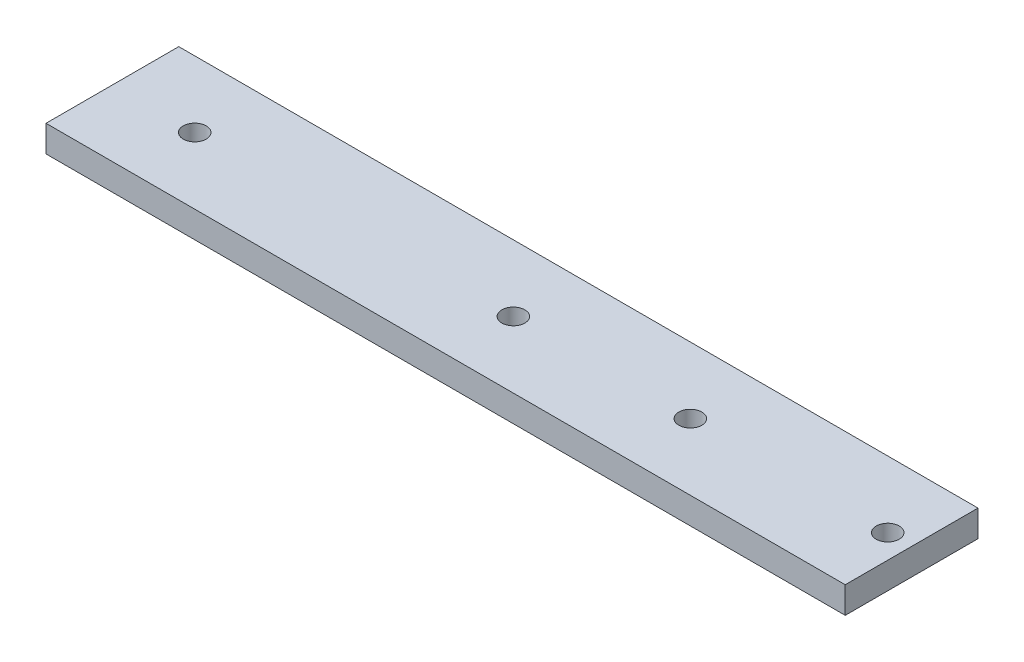
ISO-10303-21;
HEADER;
FILE_DESCRIPTION(('STEP AP214'),'2;1');
FILE_NAME('part.step','',(''),(''),'','','');
FILE_SCHEMA(('AUTOMOTIVE_DESIGN { 1 0 10303 214 1 1 1 1 }'));
ENDSEC;
DATA;
#1=APPLICATION_CONTEXT('core data for automotive mechanical design processes');
#2=APPLICATION_PROTOCOL_DEFINITION('international standard','automotive_design',2000,#1);
#3=PRODUCT_CONTEXT('',#1,'mechanical');
#4=PRODUCT('Part','Part','',(#3));
#5=PRODUCT_RELATED_PRODUCT_CATEGORY('part','',(#4));
#6=PRODUCT_DEFINITION_FORMATION('','',#4);
#7=PRODUCT_DEFINITION_CONTEXT('part definition',#1,'design');
#8=PRODUCT_DEFINITION('design','',#6,#7);
#9=PRODUCT_DEFINITION_SHAPE('','',#8);
#10=(LENGTH_UNIT() NAMED_UNIT(*) SI_UNIT(.MILLI.,.METRE.));
#11=(NAMED_UNIT(*) PLANE_ANGLE_UNIT() SI_UNIT($,.RADIAN.));
#12=(NAMED_UNIT(*) SI_UNIT($,.STERADIAN.) SOLID_ANGLE_UNIT());
#13=UNCERTAINTY_MEASURE_WITH_UNIT(LENGTH_MEASURE(1.E-05),#10,'distance_accuracy_value','');
#14=(GEOMETRIC_REPRESENTATION_CONTEXT(3) GLOBAL_UNCERTAINTY_ASSIGNED_CONTEXT((#13)) GLOBAL_UNIT_ASSIGNED_CONTEXT((#10,
#11,#12)) REPRESENTATION_CONTEXT('',''));
#15=CARTESIAN_POINT('',(0.,0.,0.));
#16=DIRECTION('',(0.,0.,1.));
#17=DIRECTION('',(1.,0.,0.));
#18=AXIS2_PLACEMENT_3D('',#15,#16,#17);
#19=CARTESIAN_POINT('',(0.,3.,0.));
#20=DIRECTION('',(0.,-1.,0.));
#21=DIRECTION('',(0.,0.,-1.));
#22=AXIS2_PLACEMENT_3D('',#19,#20,#21);
#23=PLANE('',#22);
#24=DIRECTION('',(-1.,0.,0.));
#25=VECTOR('',#24,1.);
#26=CARTESIAN_POINT('',(-65.3033815212015,3.,-7.5));
#27=LINE('',#26,#25);
#28=CARTESIAN_POINT('',(25.,3.,-7.5));
#29=VERTEX_POINT('',#28);
#30=CARTESIAN_POINT('',(-65.3033815212015,3.,-7.5));
#31=VERTEX_POINT('',#30);
#32=EDGE_CURVE('E85',#29,#31,#27,.T.);
#33=ORIENTED_EDGE('',*,*,#32,.T.);
#34=DIRECTION('',(0.,0.,1.));
#35=VECTOR('',#34,1.);
#36=CARTESIAN_POINT('',(-65.3033815212015,3.,-7.5));
#37=LINE('',#36,#35);
#38=CARTESIAN_POINT('',(-65.3033815212015,3.,7.50000000000001));
#39=VERTEX_POINT('',#38);
#40=EDGE_CURVE('E80',#31,#39,#37,.T.);
#41=ORIENTED_EDGE('',*,*,#40,.T.);
#42=DIRECTION('',(1.,0.,0.));
#43=VECTOR('',#42,1.);
#44=CARTESIAN_POINT('',(-56.,3.,7.50000000000001));
#45=LINE('',#44,#43);
#46=CARTESIAN_POINT('',(25.,3.,7.5));
#47=VERTEX_POINT('',#46);
#48=EDGE_CURVE('E83',#39,#47,#45,.T.);
#49=ORIENTED_EDGE('',*,*,#48,.T.);
#50=DIRECTION('',(0.,0.,-1.));
#51=VECTOR('',#50,1.);
#52=CARTESIAN_POINT('',(25.,3.,0.));
#53=LINE('',#52,#51);
#54=EDGE_CURVE('E52',#47,#29,#53,.T.);
#55=ORIENTED_EDGE('',*,*,#54,.T.);
#56=EDGE_LOOP('',(#33,#41,#49,#55));
#57=FACE_BOUND('',#56,.T.);
#58=CARTESIAN_POINT('',(-56.,3.,0.));
#59=DIRECTION('',(0.,1.,0.));
#60=DIRECTION('',(0.,0.,1.));
#61=AXIS2_PLACEMENT_3D('',#58,#59,#60);
#62=CIRCLE('',#61,1.3);
#63=CARTESIAN_POINT('',(-56.,3.,1.3));
#64=VERTEX_POINT('',#63);
#65=EDGE_CURVE('E102',#64,#64,#62,.T.);
#66=ORIENTED_EDGE('',*,*,#65,.F.);
#67=EDGE_LOOP('',(#66));
#68=FACE_BOUND('',#67,.T.);
#69=CARTESIAN_POINT('',(-20.,3.,0.));
#70=DIRECTION('',(0.,1.,0.));
#71=DIRECTION('',(0.,0.,1.));
#72=AXIS2_PLACEMENT_3D('',#69,#70,#71);
#73=CIRCLE('',#72,1.3);
#74=CARTESIAN_POINT('',(-20.,3.,1.3));
#75=VERTEX_POINT('',#74);
#76=EDGE_CURVE('E135',#75,#75,#73,.T.);
#77=ORIENTED_EDGE('',*,*,#76,.F.);
#78=EDGE_LOOP('',(#77));
#79=FACE_BOUND('',#78,.T.);
#80=CARTESIAN_POINT('',(0.,3.,0.));
#81=DIRECTION('',(0.,1.,0.));
#82=DIRECTION('',(0.,0.,1.));
#83=AXIS2_PLACEMENT_3D('',#80,#81,#82);
#84=CIRCLE('',#83,1.3);
#85=CARTESIAN_POINT('',(0.,3.,1.3));
#86=VERTEX_POINT('',#85);
#87=EDGE_CURVE('E130',#86,#86,#84,.T.);
#88=ORIENTED_EDGE('',*,*,#87,.F.);
#89=EDGE_LOOP('',(#88));
#90=FACE_BOUND('',#89,.T.);
#91=CARTESIAN_POINT('',(22.3,3.,0.));
#92=DIRECTION('',(0.,1.,0.));
#93=DIRECTION('',(0.,0.,1.));
#94=AXIS2_PLACEMENT_3D('',#91,#92,#93);
#95=CIRCLE('',#94,1.3);
#96=CARTESIAN_POINT('',(22.3,3.,1.3));
#97=VERTEX_POINT('',#96);
#98=EDGE_CURVE('E124',#97,#97,#95,.T.);
#99=ORIENTED_EDGE('',*,*,#98,.F.);
#100=EDGE_LOOP('',(#99));
#101=FACE_BOUND('',#100,.T.);
#102=ADVANCED_FACE('F35',(#57,#68,#79,#90,#101),#23,.F.);
#103=CARTESIAN_POINT('',(0.,0.,0.));
#104=DIRECTION('',(0.,-1.,0.));
#105=DIRECTION('',(0.,0.,-1.));
#106=AXIS2_PLACEMENT_3D('',#103,#104,#105);
#107=PLANE('',#106);
#108=CARTESIAN_POINT('',(0.,0.,0.));
#109=DIRECTION('',(0.,1.,0.));
#110=DIRECTION('',(0.,0.,1.));
#111=AXIS2_PLACEMENT_3D('',#108,#109,#110);
#112=CIRCLE('',#111,1.3);
#113=CARTESIAN_POINT('',(0.,0.,1.3));
#114=VERTEX_POINT('',#113);
#115=EDGE_CURVE('E127',#114,#114,#112,.T.);
#116=ORIENTED_EDGE('',*,*,#115,.T.);
#117=EDGE_LOOP('',(#116));
#118=FACE_BOUND('',#117,.T.);
#119=CARTESIAN_POINT('',(-56.,0.,0.));
#120=DIRECTION('',(0.,1.,0.));
#121=DIRECTION('',(0.,0.,1.));
#122=AXIS2_PLACEMENT_3D('',#119,#120,#121);
#123=CIRCLE('',#122,1.3);
#124=CARTESIAN_POINT('',(-56.,0.,1.3));
#125=VERTEX_POINT('',#124);
#126=EDGE_CURVE('E138',#125,#125,#123,.T.);
#127=ORIENTED_EDGE('',*,*,#126,.T.);
#128=EDGE_LOOP('',(#127));
#129=FACE_BOUND('',#128,.T.);
#130=DIRECTION('',(0.,0.,1.));
#131=VECTOR('',#130,1.);
#132=CARTESIAN_POINT('',(-65.3033815212015,0.,-7.5));
#133=LINE('',#132,#131);
#134=CARTESIAN_POINT('',(-65.3033815212015,0.,-7.5));
#135=VERTEX_POINT('',#134);
#136=CARTESIAN_POINT('',(-65.3033815212015,0.,7.50000000000001));
#137=VERTEX_POINT('',#136);
#138=EDGE_CURVE('E91',#135,#137,#133,.T.);
#139=ORIENTED_EDGE('',*,*,#138,.F.);
#140=DIRECTION('',(-1.,0.,0.));
#141=VECTOR('',#140,1.);
#142=CARTESIAN_POINT('',(0.,0.,-7.5));
#143=LINE('',#142,#141);
#144=CARTESIAN_POINT('',(25.,0.,-7.5));
#145=VERTEX_POINT('',#144);
#146=EDGE_CURVE('E105',#145,#135,#143,.T.);
#147=ORIENTED_EDGE('',*,*,#146,.F.);
#148=DIRECTION('',(0.,0.,-1.));
#149=VECTOR('',#148,1.);
#150=CARTESIAN_POINT('',(25.,0.,-7.5));
#151=LINE('',#150,#149);
#152=CARTESIAN_POINT('',(25.,0.,7.5));
#153=VERTEX_POINT('',#152);
#154=EDGE_CURVE('E68',#153,#145,#151,.T.);
#155=ORIENTED_EDGE('',*,*,#154,.F.);
#156=DIRECTION('',(1.,0.,0.));
#157=VECTOR('',#156,1.);
#158=CARTESIAN_POINT('',(25.,0.,7.5));
#159=LINE('',#158,#157);
#160=EDGE_CURVE('E101',#137,#153,#159,.T.);
#161=ORIENTED_EDGE('',*,*,#160,.F.);
#162=EDGE_LOOP('',(#139,#147,#155,#161));
#163=FACE_BOUND('',#162,.T.);
#164=CARTESIAN_POINT('',(-20.,0.,0.));
#165=DIRECTION('',(0.,1.,0.));
#166=DIRECTION('',(0.,0.,1.));
#167=AXIS2_PLACEMENT_3D('',#164,#165,#166);
#168=CIRCLE('',#167,1.3);
#169=CARTESIAN_POINT('',(-20.,0.,1.3));
#170=VERTEX_POINT('',#169);
#171=EDGE_CURVE('E119',#170,#170,#168,.T.);
#172=ORIENTED_EDGE('',*,*,#171,.T.);
#173=EDGE_LOOP('',(#172));
#174=FACE_BOUND('',#173,.T.);
#175=CARTESIAN_POINT('',(22.3,0.,0.));
#176=DIRECTION('',(0.,1.,0.));
#177=DIRECTION('',(0.,0.,1.));
#178=AXIS2_PLACEMENT_3D('',#175,#176,#177);
#179=CIRCLE('',#178,1.3);
#180=CARTESIAN_POINT('',(22.3,0.,1.3));
#181=VERTEX_POINT('',#180);
#182=EDGE_CURVE('E122',#181,#181,#179,.T.);
#183=ORIENTED_EDGE('',*,*,#182,.T.);
#184=EDGE_LOOP('',(#183));
#185=FACE_BOUND('',#184,.T.);
#186=ADVANCED_FACE('F111',(#118,#129,#163,#174,#185),#107,.T.);
#187=CARTESIAN_POINT('',(-65.3033815212015,3.,-7.5));
#188=DIRECTION('',(1.,0.,0.));
#189=DIRECTION('',(0.,0.,-1.));
#190=AXIS2_PLACEMENT_3D('',#187,#188,#189);
#191=PLANE('',#190);
#192=ORIENTED_EDGE('',*,*,#138,.T.);
#193=DIRECTION('',(0.,-1.,0.));
#194=VECTOR('',#193,1.);
#195=CARTESIAN_POINT('',(-65.3033815212015,3.,7.50000000000001));
#196=LINE('',#195,#194);
#197=EDGE_CURVE('E44',#39,#137,#196,.T.);
#198=ORIENTED_EDGE('',*,*,#197,.F.);
#199=ORIENTED_EDGE('',*,*,#40,.F.);
#200=DIRECTION('',(0.,-1.,0.));
#201=VECTOR('',#200,1.);
#202=CARTESIAN_POINT('',(-65.3033815212015,3.,-7.5));
#203=LINE('',#202,#201);
#204=EDGE_CURVE('E11',#31,#135,#203,.T.);
#205=ORIENTED_EDGE('',*,*,#204,.T.);
#206=EDGE_LOOP('',(#192,#198,#199,#205));
#207=FACE_BOUND('',#206,.T.);
#208=ADVANCED_FACE('F37',(#207),#191,.F.);
#209=CARTESIAN_POINT('',(25.,3.,7.5));
#210=DIRECTION('',(0.,0.,-1.));
#211=DIRECTION('',(-1.,0.,0.));
#212=AXIS2_PLACEMENT_3D('',#209,#210,#211);
#213=PLANE('',#212);
#214=ORIENTED_EDGE('',*,*,#160,.T.);
#215=DIRECTION('',(0.,-1.,0.));
#216=VECTOR('',#215,1.);
#217=CARTESIAN_POINT('',(25.,3.,7.5));
#218=LINE('',#217,#216);
#219=EDGE_CURVE('E93',#47,#153,#218,.T.);
#220=ORIENTED_EDGE('',*,*,#219,.F.);
#221=ORIENTED_EDGE('',*,*,#48,.F.);
#222=ORIENTED_EDGE('',*,*,#197,.T.);
#223=EDGE_LOOP('',(#214,#220,#221,#222));
#224=FACE_BOUND('',#223,.T.);
#225=ADVANCED_FACE('F94',(#224),#213,.F.);
#226=CARTESIAN_POINT('',(25.,3.,-7.5));
#227=DIRECTION('',(-1.,0.,0.));
#228=DIRECTION('',(0.,0.,1.));
#229=AXIS2_PLACEMENT_3D('',#226,#227,#228);
#230=PLANE('',#229);
#231=ORIENTED_EDGE('',*,*,#154,.T.);
#232=DIRECTION('',(0.,-1.,0.));
#233=VECTOR('',#232,1.);
#234=CARTESIAN_POINT('',(25.,3.,-7.5));
#235=LINE('',#234,#233);
#236=EDGE_CURVE('E96',#29,#145,#235,.T.);
#237=ORIENTED_EDGE('',*,*,#236,.F.);
#238=ORIENTED_EDGE('',*,*,#54,.F.);
#239=ORIENTED_EDGE('',*,*,#219,.T.);
#240=EDGE_LOOP('',(#231,#237,#238,#239));
#241=FACE_BOUND('',#240,.T.);
#242=ADVANCED_FACE('F108',(#241),#230,.F.);
#243=CARTESIAN_POINT('',(0.,3.,-7.5));
#244=DIRECTION('',(0.,0.,1.));
#245=DIRECTION('',(1.,0.,0.));
#246=AXIS2_PLACEMENT_3D('',#243,#244,#245);
#247=PLANE('',#246);
#248=ORIENTED_EDGE('',*,*,#146,.T.);
#249=ORIENTED_EDGE('',*,*,#204,.F.);
#250=ORIENTED_EDGE('',*,*,#32,.F.);
#251=ORIENTED_EDGE('',*,*,#236,.T.);
#252=EDGE_LOOP('',(#248,#249,#250,#251));
#253=FACE_BOUND('',#252,.T.);
#254=ADVANCED_FACE('F110',(#253),#247,.F.);
#255=CARTESIAN_POINT('',(-56.,3.,0.));
#256=DIRECTION('',(0.,-1.,0.));
#257=DIRECTION('',(0.,0.,-1.));
#258=AXIS2_PLACEMENT_3D('',#255,#256,#257);
#259=CYLINDRICAL_SURFACE('',#258,1.3);
#260=ORIENTED_EDGE('',*,*,#65,.T.);
#261=EDGE_LOOP('',(#260));
#262=FACE_BOUND('',#261,.T.);
#263=ORIENTED_EDGE('',*,*,#126,.F.);
#264=EDGE_LOOP('',(#263));
#265=FACE_BOUND('',#264,.T.);
#266=ADVANCED_FACE('F146',(#262,#265),#259,.F.);
#267=CARTESIAN_POINT('',(-20.,3.,0.));
#268=DIRECTION('',(0.,-1.,0.));
#269=DIRECTION('',(0.,0.,-1.));
#270=AXIS2_PLACEMENT_3D('',#267,#268,#269);
#271=CYLINDRICAL_SURFACE('',#270,1.3);
#272=ORIENTED_EDGE('',*,*,#76,.T.);
#273=EDGE_LOOP('',(#272));
#274=FACE_BOUND('',#273,.T.);
#275=ORIENTED_EDGE('',*,*,#171,.F.);
#276=EDGE_LOOP('',(#275));
#277=FACE_BOUND('',#276,.T.);
#278=ADVANCED_FACE('F148',(#274,#277),#271,.F.);
#279=CARTESIAN_POINT('',(0.,3.,0.));
#280=DIRECTION('',(0.,-1.,0.));
#281=DIRECTION('',(0.,0.,-1.));
#282=AXIS2_PLACEMENT_3D('',#279,#280,#281);
#283=CYLINDRICAL_SURFACE('',#282,1.3);
#284=ORIENTED_EDGE('',*,*,#87,.T.);
#285=EDGE_LOOP('',(#284));
#286=FACE_BOUND('',#285,.T.);
#287=ORIENTED_EDGE('',*,*,#115,.F.);
#288=EDGE_LOOP('',(#287));
#289=FACE_BOUND('',#288,.T.);
#290=ADVANCED_FACE('F155',(#286,#289),#283,.F.);
#291=CARTESIAN_POINT('',(22.3,3.,0.));
#292=DIRECTION('',(0.,-1.,0.));
#293=DIRECTION('',(0.,0.,-1.));
#294=AXIS2_PLACEMENT_3D('',#291,#292,#293);
#295=CYLINDRICAL_SURFACE('',#294,1.3);
#296=ORIENTED_EDGE('',*,*,#98,.T.);
#297=EDGE_LOOP('',(#296));
#298=FACE_BOUND('',#297,.T.);
#299=ORIENTED_EDGE('',*,*,#182,.F.);
#300=EDGE_LOOP('',(#299));
#301=FACE_BOUND('',#300,.T.);
#302=ADVANCED_FACE('F229',(#298,#301),#295,.F.);
#303=CLOSED_SHELL('',(#102,#186,#208,#225,#242,#254,#266,#278,#290,#302));
#304=MANIFOLD_SOLID_BREP('B2',#303);
#305=ADVANCED_BREP_SHAPE_REPRESENTATION('',(#18,#304),#14);
#306=SHAPE_DEFINITION_REPRESENTATION(#9,#305);
ENDSEC;
END-ISO-10303-21;
